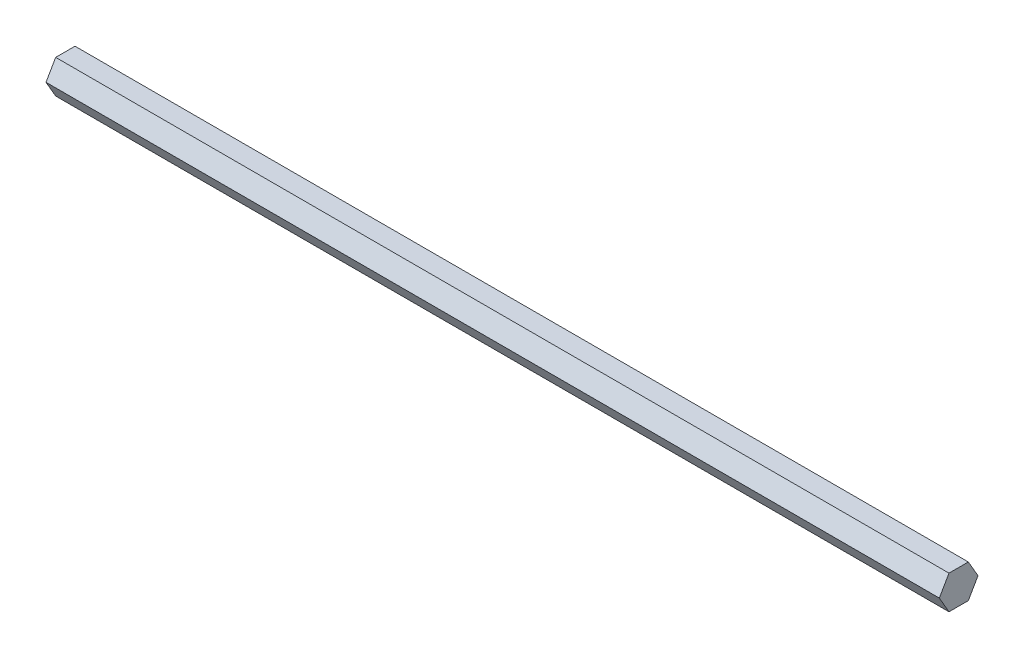
ISO-10303-21;
HEADER;
FILE_DESCRIPTION(('STEP AP214'),'2;1');
FILE_NAME('part.step','',(''),(''),'','','');
FILE_SCHEMA(('AUTOMOTIVE_DESIGN { 1 0 10303 214 1 1 1 1 }'));
ENDSEC;
DATA;
#1=APPLICATION_CONTEXT('core data for automotive mechanical design processes');
#2=APPLICATION_PROTOCOL_DEFINITION('international standard','automotive_design',2000,#1);
#3=PRODUCT_CONTEXT('',#1,'mechanical');
#4=PRODUCT('Part','Part','',(#3));
#5=PRODUCT_RELATED_PRODUCT_CATEGORY('part','',(#4));
#6=PRODUCT_DEFINITION_FORMATION('','',#4);
#7=PRODUCT_DEFINITION_CONTEXT('part definition',#1,'design');
#8=PRODUCT_DEFINITION('design','',#6,#7);
#9=PRODUCT_DEFINITION_SHAPE('','',#8);
#10=(LENGTH_UNIT() NAMED_UNIT(*) SI_UNIT(.MILLI.,.METRE.));
#11=(NAMED_UNIT(*) PLANE_ANGLE_UNIT() SI_UNIT($,.RADIAN.));
#12=(NAMED_UNIT(*) SI_UNIT($,.STERADIAN.) SOLID_ANGLE_UNIT());
#13=UNCERTAINTY_MEASURE_WITH_UNIT(LENGTH_MEASURE(1.E-05),#10,'distance_accuracy_value','');
#14=(GEOMETRIC_REPRESENTATION_CONTEXT(3) GLOBAL_UNCERTAINTY_ASSIGNED_CONTEXT((#13)) GLOBAL_UNIT_ASSIGNED_CONTEXT((#10,
#11,#12)) REPRESENTATION_CONTEXT('',''));
#15=CARTESIAN_POINT('',(0.,0.,0.));
#16=DIRECTION('',(0.,0.,1.));
#17=DIRECTION('',(1.,0.,0.));
#18=AXIS2_PLACEMENT_3D('',#15,#16,#17);
#19=CARTESIAN_POINT('',(127.,-4.7625,2.74963065701559));
#20=DIRECTION('',(0.,1.,0.));
#21=DIRECTION('',(0.,0.,1.));
#22=AXIS2_PLACEMENT_3D('',#19,#20,#21);
#23=PLANE('',#22);
#24=DIRECTION('',(0.,0.,-1.));
#25=VECTOR('',#24,1.);
#26=CARTESIAN_POINT('',(-127.,-4.7625,2.74963065701559));
#27=LINE('',#26,#25);
#28=CARTESIAN_POINT('',(-127.,-4.7625,2.74963065701559));
#29=VERTEX_POINT('',#28);
#30=CARTESIAN_POINT('',(-127.,-4.7625,-2.74963065701559));
#31=VERTEX_POINT('',#30);
#32=EDGE_CURVE('E128',#29,#31,#27,.T.);
#33=ORIENTED_EDGE('',*,*,#32,.T.);
#34=DIRECTION('',(-1.,0.,0.));
#35=VECTOR('',#34,1.);
#36=CARTESIAN_POINT('',(127.,-4.7625,-2.74963065701559));
#37=LINE('',#36,#35);
#38=CARTESIAN_POINT('',(127.,-4.7625,-2.74963065701559));
#39=VERTEX_POINT('',#38);
#40=EDGE_CURVE('E11',#39,#31,#37,.T.);
#41=ORIENTED_EDGE('',*,*,#40,.F.);
#42=DIRECTION('',(0.,0.,-1.));
#43=VECTOR('',#42,1.);
#44=CARTESIAN_POINT('',(127.,-4.7625,2.74963065701559));
#45=LINE('',#44,#43);
#46=CARTESIAN_POINT('',(127.,-4.7625,2.74963065701559));
#47=VERTEX_POINT('',#46);
#48=EDGE_CURVE('E144',#47,#39,#45,.T.);
#49=ORIENTED_EDGE('',*,*,#48,.F.);
#50=DIRECTION('',(-1.,0.,0.));
#51=VECTOR('',#50,1.);
#52=CARTESIAN_POINT('',(127.,-4.7625,2.74963065701559));
#53=LINE('',#52,#51);
#54=EDGE_CURVE('E124',#47,#29,#53,.T.);
#55=ORIENTED_EDGE('',*,*,#54,.T.);
#56=EDGE_LOOP('',(#33,#41,#49,#55));
#57=FACE_BOUND('',#56,.T.);
#58=ADVANCED_FACE('F39',(#57),#23,.F.);
#59=CARTESIAN_POINT('',(127.,-4.7625,-2.74963065701559));
#60=DIRECTION('',(0.,0.5,0.866025403784439));
#61=DIRECTION('',(0.,-0.866025403784439,0.5));
#62=AXIS2_PLACEMENT_3D('',#59,#60,#61);
#63=PLANE('',#62);
#64=DIRECTION('',(0.,0.866025403784439,-0.5));
#65=VECTOR('',#64,1.);
#66=CARTESIAN_POINT('',(-127.,-4.7625,-2.74963065701559));
#67=LINE('',#66,#65);
#68=CARTESIAN_POINT('',(-127.,0.,-5.49926131403118));
#69=VERTEX_POINT('',#68);
#70=EDGE_CURVE('E132',#31,#69,#67,.T.);
#71=ORIENTED_EDGE('',*,*,#70,.T.);
#72=DIRECTION('',(-1.,0.,0.));
#73=VECTOR('',#72,1.);
#74=CARTESIAN_POINT('',(127.,0.,-5.49926131403118));
#75=LINE('',#74,#73);
#76=CARTESIAN_POINT('',(127.,0.,-5.49926131403118));
#77=VERTEX_POINT('',#76);
#78=EDGE_CURVE('E48',#77,#69,#75,.T.);
#79=ORIENTED_EDGE('',*,*,#78,.F.);
#80=DIRECTION('',(0.,0.866025403784439,-0.5));
#81=VECTOR('',#80,1.);
#82=CARTESIAN_POINT('',(127.,-4.7625,-2.74963065701559));
#83=LINE('',#82,#81);
#84=EDGE_CURVE('E93',#39,#77,#83,.T.);
#85=ORIENTED_EDGE('',*,*,#84,.F.);
#86=ORIENTED_EDGE('',*,*,#40,.T.);
#87=EDGE_LOOP('',(#71,#79,#85,#86));
#88=FACE_BOUND('',#87,.T.);
#89=ADVANCED_FACE('F172',(#88),#63,.F.);
#90=CARTESIAN_POINT('',(127.,0.,-5.49926131403118));
#91=DIRECTION('',(0.,-0.5,0.866025403784438));
#92=DIRECTION('',(0.,-0.866025403784439,-0.5));
#93=AXIS2_PLACEMENT_3D('',#90,#91,#92);
#94=PLANE('',#93);
#95=DIRECTION('',(0.,0.866025403784438,0.5));
#96=VECTOR('',#95,1.);
#97=CARTESIAN_POINT('',(-127.,0.,-5.49926131403118));
#98=LINE('',#97,#96);
#99=CARTESIAN_POINT('',(-127.,4.7625,-2.74963065701559));
#100=VERTEX_POINT('',#99);
#101=EDGE_CURVE('E135',#69,#100,#98,.T.);
#102=ORIENTED_EDGE('',*,*,#101,.T.);
#103=DIRECTION('',(-1.,0.,0.));
#104=VECTOR('',#103,1.);
#105=CARTESIAN_POINT('',(127.,4.7625,-2.74963065701559));
#106=LINE('',#105,#104);
#107=CARTESIAN_POINT('',(127.,4.7625,-2.74963065701559));
#108=VERTEX_POINT('',#107);
#109=EDGE_CURVE('E117',#108,#100,#106,.T.);
#110=ORIENTED_EDGE('',*,*,#109,.F.);
#111=DIRECTION('',(0.,0.866025403784438,0.5));
#112=VECTOR('',#111,1.);
#113=CARTESIAN_POINT('',(127.,0.,-5.49926131403118));
#114=LINE('',#113,#112);
#115=EDGE_CURVE('E106',#77,#108,#114,.T.);
#116=ORIENTED_EDGE('',*,*,#115,.F.);
#117=ORIENTED_EDGE('',*,*,#78,.T.);
#118=EDGE_LOOP('',(#102,#110,#116,#117));
#119=FACE_BOUND('',#118,.T.);
#120=ADVANCED_FACE('F154',(#119),#94,.F.);
#121=CARTESIAN_POINT('',(127.,4.7625,-2.74963065701559));
#122=DIRECTION('',(0.,-1.,0.));
#123=DIRECTION('',(0.,0.,-1.));
#124=AXIS2_PLACEMENT_3D('',#121,#122,#123);
#125=PLANE('',#124);
#126=DIRECTION('',(0.,0.,1.));
#127=VECTOR('',#126,1.);
#128=CARTESIAN_POINT('',(-127.,4.7625,-2.74963065701559));
#129=LINE('',#128,#127);
#130=CARTESIAN_POINT('',(-127.,4.7625,2.74963065701559));
#131=VERTEX_POINT('',#130);
#132=EDGE_CURVE('E115',#100,#131,#129,.T.);
#133=ORIENTED_EDGE('',*,*,#132,.T.);
#134=DIRECTION('',(-1.,0.,0.));
#135=VECTOR('',#134,1.);
#136=CARTESIAN_POINT('',(127.,4.7625,2.74963065701559));
#137=LINE('',#136,#135);
#138=CARTESIAN_POINT('',(127.,4.7625,2.74963065701559));
#139=VERTEX_POINT('',#138);
#140=EDGE_CURVE('E112',#139,#131,#137,.T.);
#141=ORIENTED_EDGE('',*,*,#140,.F.);
#142=DIRECTION('',(0.,0.,1.));
#143=VECTOR('',#142,1.);
#144=CARTESIAN_POINT('',(127.,4.7625,-2.74963065701559));
#145=LINE('',#144,#143);
#146=EDGE_CURVE('E100',#108,#139,#145,.T.);
#147=ORIENTED_EDGE('',*,*,#146,.F.);
#148=ORIENTED_EDGE('',*,*,#109,.T.);
#149=EDGE_LOOP('',(#133,#141,#147,#148));
#150=FACE_BOUND('',#149,.T.);
#151=ADVANCED_FACE('F113',(#150),#125,.F.);
#152=CARTESIAN_POINT('',(127.,4.7625,2.74963065701559));
#153=DIRECTION('',(0.,-0.5,-0.866025403784439));
#154=DIRECTION('',(0.,0.866025403784439,-0.5));
#155=AXIS2_PLACEMENT_3D('',#152,#153,#154);
#156=PLANE('',#155);
#157=DIRECTION('',(0.,-0.866025403784439,0.5));
#158=VECTOR('',#157,1.);
#159=CARTESIAN_POINT('',(-127.,4.7625,2.74963065701559));
#160=LINE('',#159,#158);
#161=CARTESIAN_POINT('',(-127.,0.,5.49926131403118));
#162=VERTEX_POINT('',#161);
#163=EDGE_CURVE('E79',#131,#162,#160,.T.);
#164=ORIENTED_EDGE('',*,*,#163,.T.);
#165=DIRECTION('',(-1.,0.,0.));
#166=VECTOR('',#165,1.);
#167=CARTESIAN_POINT('',(127.,0.,5.49926131403118));
#168=LINE('',#167,#166);
#169=CARTESIAN_POINT('',(127.,0.,5.49926131403118));
#170=VERTEX_POINT('',#169);
#171=EDGE_CURVE('E118',#170,#162,#168,.T.);
#172=ORIENTED_EDGE('',*,*,#171,.F.);
#173=DIRECTION('',(0.,-0.866025403784439,0.5));
#174=VECTOR('',#173,1.);
#175=CARTESIAN_POINT('',(127.,4.7625,2.74963065701559));
#176=LINE('',#175,#174);
#177=EDGE_CURVE('E104',#139,#170,#176,.T.);
#178=ORIENTED_EDGE('',*,*,#177,.F.);
#179=ORIENTED_EDGE('',*,*,#140,.T.);
#180=EDGE_LOOP('',(#164,#172,#178,#179));
#181=FACE_BOUND('',#180,.T.);
#182=ADVANCED_FACE('F120',(#181),#156,.F.);
#183=CARTESIAN_POINT('',(127.,0.,5.49926131403118));
#184=DIRECTION('',(0.,0.5,-0.866025403784438));
#185=DIRECTION('',(0.,0.866025403784439,0.5));
#186=AXIS2_PLACEMENT_3D('',#183,#184,#185);
#187=PLANE('',#186);
#188=DIRECTION('',(0.,-0.866025403784439,-0.5));
#189=VECTOR('',#188,1.);
#190=CARTESIAN_POINT('',(-127.,0.,5.49926131403118));
#191=LINE('',#190,#189);
#192=EDGE_CURVE('E85',#162,#29,#191,.T.);
#193=ORIENTED_EDGE('',*,*,#192,.T.);
#194=ORIENTED_EDGE('',*,*,#54,.F.);
#195=DIRECTION('',(0.,-0.866025403784439,-0.5));
#196=VECTOR('',#195,1.);
#197=CARTESIAN_POINT('',(127.,0.,5.49926131403118));
#198=LINE('',#197,#196);
#199=EDGE_CURVE('E56',#170,#47,#198,.T.);
#200=ORIENTED_EDGE('',*,*,#199,.F.);
#201=ORIENTED_EDGE('',*,*,#171,.T.);
#202=EDGE_LOOP('',(#193,#194,#200,#201));
#203=FACE_BOUND('',#202,.T.);
#204=ADVANCED_FACE('F161',(#203),#187,.F.);
#205=CARTESIAN_POINT('',(127.,0.,0.));
#206=DIRECTION('',(1.,0.,0.));
#207=DIRECTION('',(0.,0.,-1.));
#208=AXIS2_PLACEMENT_3D('',#205,#206,#207);
#209=PLANE('',#208);
#210=ORIENTED_EDGE('',*,*,#48,.T.);
#211=ORIENTED_EDGE('',*,*,#84,.T.);
#212=ORIENTED_EDGE('',*,*,#115,.T.);
#213=ORIENTED_EDGE('',*,*,#146,.T.);
#214=ORIENTED_EDGE('',*,*,#177,.T.);
#215=ORIENTED_EDGE('',*,*,#199,.T.);
#216=EDGE_LOOP('',(#210,#211,#212,#213,#214,#215));
#217=FACE_BOUND('',#216,.T.);
#218=ADVANCED_FACE('F102',(#217),#209,.T.);
#219=CARTESIAN_POINT('',(-127.,0.,0.));
#220=DIRECTION('',(1.,0.,0.));
#221=DIRECTION('',(0.,0.,-1.));
#222=AXIS2_PLACEMENT_3D('',#219,#220,#221);
#223=PLANE('',#222);
#224=ORIENTED_EDGE('',*,*,#32,.F.);
#225=ORIENTED_EDGE('',*,*,#192,.F.);
#226=ORIENTED_EDGE('',*,*,#163,.F.);
#227=ORIENTED_EDGE('',*,*,#132,.F.);
#228=ORIENTED_EDGE('',*,*,#101,.F.);
#229=ORIENTED_EDGE('',*,*,#70,.F.);
#230=EDGE_LOOP('',(#224,#225,#226,#227,#228,#229));
#231=FACE_BOUND('',#230,.T.);
#232=ADVANCED_FACE('F157',(#231),#223,.F.);
#233=CLOSED_SHELL('',(#58,#89,#120,#151,#182,#204,#218,#232));
#234=MANIFOLD_SOLID_BREP('B2',#233);
#235=ADVANCED_BREP_SHAPE_REPRESENTATION('',(#18,#234),#14);
#236=SHAPE_DEFINITION_REPRESENTATION(#9,#235);
ENDSEC;
END-ISO-10303-21;
